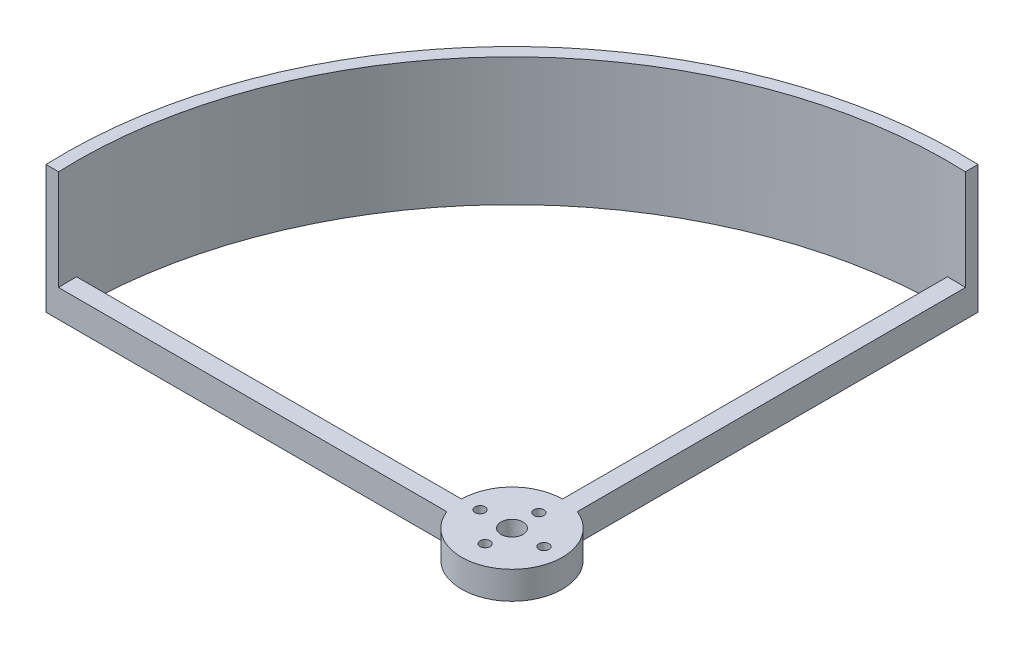
ISO-10303-21;
HEADER;
FILE_DESCRIPTION(('STEP AP214'),'2;1');
FILE_NAME('part.step','',(''),(''),'','','');
FILE_SCHEMA(('AUTOMOTIVE_DESIGN { 1 0 10303 214 1 1 1 1 }'));
ENDSEC;
DATA;
#1=APPLICATION_CONTEXT('core data for automotive mechanical design processes');
#2=APPLICATION_PROTOCOL_DEFINITION('international standard','automotive_design',2000,#1);
#3=PRODUCT_CONTEXT('',#1,'mechanical');
#4=PRODUCT('Part','Part','',(#3));
#5=PRODUCT_RELATED_PRODUCT_CATEGORY('part','',(#4));
#6=PRODUCT_DEFINITION_FORMATION('','',#4);
#7=PRODUCT_DEFINITION_CONTEXT('part definition',#1,'design');
#8=PRODUCT_DEFINITION('design','',#6,#7);
#9=PRODUCT_DEFINITION_SHAPE('','',#8);
#10=(LENGTH_UNIT() NAMED_UNIT(*) SI_UNIT(.MILLI.,.METRE.));
#11=(NAMED_UNIT(*) PLANE_ANGLE_UNIT() SI_UNIT($,.RADIAN.));
#12=(NAMED_UNIT(*) SI_UNIT($,.STERADIAN.) SOLID_ANGLE_UNIT());
#13=UNCERTAINTY_MEASURE_WITH_UNIT(LENGTH_MEASURE(1.E-05),#10,'distance_accuracy_value','');
#14=(GEOMETRIC_REPRESENTATION_CONTEXT(3) GLOBAL_UNCERTAINTY_ASSIGNED_CONTEXT((#13)) GLOBAL_UNIT_ASSIGNED_CONTEXT((#10,
#11,#12)) REPRESENTATION_CONTEXT('',''));
#15=CARTESIAN_POINT('',(0.,0.,0.));
#16=DIRECTION('',(0.,0.,1.));
#17=DIRECTION('',(1.,0.,0.));
#18=AXIS2_PLACEMENT_3D('',#15,#16,#17);
#19=CARTESIAN_POINT('',(0.,8.255,0.));
#20=DIRECTION('',(0.,-1.,0.));
#21=DIRECTION('',(0.,0.,-1.));
#22=AXIS2_PLACEMENT_3D('',#19,#20,#21);
#23=CYLINDRICAL_SURFACE('',#22,15.);
#24=DIRECTION('',(0.,-1.,0.));
#25=VECTOR('',#24,1.);
#26=CARTESIAN_POINT('',(5.45158795707583,8.255,-13.9742688090027));
#27=LINE('',#26,#25);
#28=CARTESIAN_POINT('',(5.45158795707583,8.255,-13.9742688090027));
#29=VERTEX_POINT('',#28);
#30=CARTESIAN_POINT('',(5.45158795707583,0.,-13.9742688090027));
#31=VERTEX_POINT('',#30);
#32=EDGE_CURVE('E60',#29,#31,#27,.T.);
#33=ORIENTED_EDGE('',*,*,#32,.F.);
#34=CARTESIAN_POINT('',(0.,8.255,0.));
#35=DIRECTION('',(0.,1.,0.));
#36=DIRECTION('',(0.,0.,1.));
#37=AXIS2_PLACEMENT_3D('',#34,#35,#36);
#38=CIRCLE('',#37,15.);
#39=CARTESIAN_POINT('',(-13.9742688090027,8.255,5.45158795707584));
#40=VERTEX_POINT('',#39);
#41=EDGE_CURVE('E11',#40,#29,#38,.T.);
#42=ORIENTED_EDGE('',*,*,#41,.F.);
#43=DIRECTION('',(0.,-1.,0.));
#44=VECTOR('',#43,1.);
#45=CARTESIAN_POINT('',(-13.9742688090027,8.255,5.45158795707584));
#46=LINE('',#45,#44);
#47=CARTESIAN_POINT('',(-13.9742688090027,0.,5.45158795707584));
#48=VERTEX_POINT('',#47);
#49=EDGE_CURVE('E181',#40,#48,#46,.T.);
#50=ORIENTED_EDGE('',*,*,#49,.T.);
#51=CARTESIAN_POINT('',(0.,0.,0.));
#52=DIRECTION('',(0.,1.,0.));
#53=DIRECTION('',(0.,0.,1.));
#54=AXIS2_PLACEMENT_3D('',#51,#52,#53);
#55=CIRCLE('',#54,15.);
#56=EDGE_CURVE('E187',#48,#31,#55,.T.);
#57=ORIENTED_EDGE('',*,*,#56,.T.);
#58=EDGE_LOOP('',(#33,#42,#50,#57));
#59=FACE_BOUND('',#58,.T.);
#60=ADVANCED_FACE('F37',(#59),#23,.T.);
#61=DIRECTION('',(0.,-1.,0.));
#62=VECTOR('',#61,1.);
#63=CARTESIAN_POINT('',(0.,8.255,-15.));
#64=LINE('',#63,#62);
#65=CARTESIAN_POINT('',(0.,8.255,-15.));
#66=VERTEX_POINT('',#65);
#67=CARTESIAN_POINT('',(0.,0.,-15.));
#68=VERTEX_POINT('',#67);
#69=EDGE_CURVE('E159',#66,#68,#64,.T.);
#70=ORIENTED_EDGE('',*,*,#69,.T.);
#71=CARTESIAN_POINT('',(-15.,0.,0.));
#72=VERTEX_POINT('',#71);
#73=EDGE_CURVE('E185',#68,#72,#55,.T.);
#74=ORIENTED_EDGE('',*,*,#73,.T.);
#75=DIRECTION('',(0.,-1.,0.));
#76=VECTOR('',#75,1.);
#77=CARTESIAN_POINT('',(-15.,8.255,0.));
#78=LINE('',#77,#76);
#79=CARTESIAN_POINT('',(-15.,8.255,0.));
#80=VERTEX_POINT('',#79);
#81=EDGE_CURVE('E175',#80,#72,#78,.T.);
#82=ORIENTED_EDGE('',*,*,#81,.F.);
#83=EDGE_CURVE('E45',#66,#80,#38,.T.);
#84=ORIENTED_EDGE('',*,*,#83,.F.);
#85=EDGE_LOOP('',(#70,#74,#82,#84));
#86=FACE_BOUND('',#85,.T.);
#87=ADVANCED_FACE('F243',(#86),#23,.T.);
#88=CARTESIAN_POINT('',(0.,8.255,0.));
#89=DIRECTION('',(0.,1.,0.));
#90=DIRECTION('',(0.,0.,1.));
#91=AXIS2_PLACEMENT_3D('',#88,#89,#90);
#92=PLANE('',#91);
#93=CARTESIAN_POINT('',(0.,8.255,8.));
#94=DIRECTION('',(0.,1.,0.));
#95=DIRECTION('',(0.,0.,-1.));
#96=AXIS2_PLACEMENT_3D('',#93,#94,#95);
#97=CIRCLE('',#96,1.5);
#98=CARTESIAN_POINT('',(0.,8.255,6.5));
#99=VERTEX_POINT('',#98);
#100=EDGE_CURVE('E213',#99,#99,#97,.T.);
#101=ORIENTED_EDGE('',*,*,#100,.F.);
#102=EDGE_LOOP('',(#101));
#103=FACE_BOUND('',#102,.T.);
#104=CARTESIAN_POINT('',(0.,8.255,0.));
#105=DIRECTION('',(0.,1.,0.));
#106=DIRECTION('',(0.,0.,1.));
#107=AXIS2_PLACEMENT_3D('',#104,#105,#106);
#108=CIRCLE('',#107,3.249999977);
#109=CARTESIAN_POINT('',(0.,8.255,3.249999977));
#110=VERTEX_POINT('',#109);
#111=EDGE_CURVE('E203',#110,#110,#108,.T.);
#112=ORIENTED_EDGE('',*,*,#111,.F.);
#113=EDGE_LOOP('',(#112));
#114=FACE_BOUND('',#113,.T.);
#115=CARTESIAN_POINT('',(9.5,8.255,0.));
#116=DIRECTION('',(0.,1.,0.));
#117=DIRECTION('',(0.,0.,1.));
#118=AXIS2_PLACEMENT_3D('',#115,#116,#117);
#119=CIRCLE('',#118,1.500000048);
#120=CARTESIAN_POINT('',(9.5,8.255,1.50000004800003));
#121=VERTEX_POINT('',#120);
#122=EDGE_CURVE('E200',#121,#121,#119,.T.);
#123=ORIENTED_EDGE('',*,*,#122,.F.);
#124=EDGE_LOOP('',(#123));
#125=FACE_BOUND('',#124,.T.);
#126=CARTESIAN_POINT('',(-9.5,8.255,0.));
#127=DIRECTION('',(0.,1.,0.));
#128=DIRECTION('',(0.,0.,-1.));
#129=AXIS2_PLACEMENT_3D('',#126,#127,#128);
#130=CIRCLE('',#129,1.500000048);
#131=CARTESIAN_POINT('',(-9.5,8.255,-1.50000004800003));
#132=VERTEX_POINT('',#131);
#133=EDGE_CURVE('E197',#132,#132,#130,.T.);
#134=ORIENTED_EDGE('',*,*,#133,.F.);
#135=EDGE_LOOP('',(#134));
#136=FACE_BOUND('',#135,.T.);
#137=CARTESIAN_POINT('',(0.,8.255,-8.));
#138=DIRECTION('',(0.,1.,0.));
#139=DIRECTION('',(0.,0.,1.));
#140=AXIS2_PLACEMENT_3D('',#137,#138,#139);
#141=CIRCLE('',#140,1.5);
#142=CARTESIAN_POINT('',(0.,8.255,-6.5));
#143=VERTEX_POINT('',#142);
#144=EDGE_CURVE('E193',#143,#143,#141,.T.);
#145=ORIENTED_EDGE('',*,*,#144,.F.);
#146=EDGE_LOOP('',(#145));
#147=FACE_BOUND('',#146,.T.);
#148=ORIENTED_EDGE('',*,*,#41,.T.);
#149=DIRECTION('',(0.,0.,-1.));
#150=VECTOR('',#149,1.);
#151=CARTESIAN_POINT('',(5.45158795707584,8.255,0.));
#152=LINE('',#151,#150);
#153=CARTESIAN_POINT('',(5.45158795707582,8.25500000000001,-129.488518037189));
#154=VERTEX_POINT('',#153);
#155=EDGE_CURVE('E148',#29,#154,#152,.T.);
#156=ORIENTED_EDGE('',*,*,#155,.T.);
#157=CARTESIAN_POINT('',(0.,8.255,0.));
#158=DIRECTION('',(0.,1.,0.));
#159=DIRECTION('',(0.,0.,1.));
#160=AXIS2_PLACEMENT_3D('',#157,#158,#159);
#161=CIRCLE('',#160,129.603225711095);
#162=CARTESIAN_POINT('',(0.,8.255,-129.603225711095));
#163=VERTEX_POINT('',#162);
#164=EDGE_CURVE('E151',#154,#163,#161,.T.);
#165=ORIENTED_EDGE('',*,*,#164,.T.);
#166=DIRECTION('',(0.,0.,1.));
#167=VECTOR('',#166,1.);
#168=CARTESIAN_POINT('',(0.,8.255,0.));
#169=LINE('',#168,#167);
#170=EDGE_CURVE('E154',#163,#66,#169,.T.);
#171=ORIENTED_EDGE('',*,*,#170,.T.);
#172=ORIENTED_EDGE('',*,*,#83,.T.);
#173=DIRECTION('',(1.,0.,0.));
#174=VECTOR('',#173,1.);
#175=CARTESIAN_POINT('',(0.,8.255,0.));
#176=LINE('',#175,#174);
#177=CARTESIAN_POINT('',(-129.603225711095,8.255,0.));
#178=VERTEX_POINT('',#177);
#179=EDGE_CURVE('E165',#178,#80,#176,.T.);
#180=ORIENTED_EDGE('',*,*,#179,.F.);
#181=CARTESIAN_POINT('',(0.,8.255,0.));
#182=DIRECTION('',(0.,1.,0.));
#183=DIRECTION('',(0.,0.,1.));
#184=AXIS2_PLACEMENT_3D('',#181,#182,#183);
#185=CIRCLE('',#184,129.603225711095);
#186=CARTESIAN_POINT('',(-129.488518037189,8.25500000000001,5.45158795707585));
#187=VERTEX_POINT('',#186);
#188=EDGE_CURVE('E168',#178,#187,#185,.T.);
#189=ORIENTED_EDGE('',*,*,#188,.T.);
#190=DIRECTION('',(-1.,0.,0.));
#191=VECTOR('',#190,1.);
#192=CARTESIAN_POINT('',(0.,8.255,5.45158795707583));
#193=LINE('',#192,#191);
#194=EDGE_CURVE('E172',#40,#187,#193,.T.);
#195=ORIENTED_EDGE('',*,*,#194,.F.);
#196=EDGE_LOOP('',(#148,#156,#165,#171,#172,#180,#189,#195));
#197=FACE_BOUND('',#196,.T.);
#198=ADVANCED_FACE('F233',(#103,#114,#125,#136,#147,#197),#92,.T.);
#199=CARTESIAN_POINT('',(0.,0.,0.));
#200=DIRECTION('',(0.,1.,0.));
#201=DIRECTION('',(0.,0.,1.));
#202=AXIS2_PLACEMENT_3D('',#199,#200,#201);
#203=PLANE('',#202);
#204=CARTESIAN_POINT('',(0.,0.,8.));
#205=DIRECTION('',(0.,1.,0.));
#206=DIRECTION('',(0.,0.,1.));
#207=AXIS2_PLACEMENT_3D('',#204,#205,#206);
#208=CIRCLE('',#207,1.5);
#209=CARTESIAN_POINT('',(0.,0.,9.5));
#210=VERTEX_POINT('',#209);
#211=EDGE_CURVE('E40',#210,#210,#208,.T.);
#212=ORIENTED_EDGE('',*,*,#211,.T.);
#213=EDGE_LOOP('',(#212));
#214=FACE_BOUND('',#213,.T.);
#215=CARTESIAN_POINT('',(0.,0.,0.));
#216=DIRECTION('',(0.,1.,0.));
#217=DIRECTION('',(0.,0.,1.));
#218=AXIS2_PLACEMENT_3D('',#215,#216,#217);
#219=CIRCLE('',#218,3.249999977);
#220=CARTESIAN_POINT('',(0.,0.,3.249999977));
#221=VERTEX_POINT('',#220);
#222=EDGE_CURVE('E201',#221,#221,#219,.T.);
#223=ORIENTED_EDGE('',*,*,#222,.T.);
#224=EDGE_LOOP('',(#223));
#225=FACE_BOUND('',#224,.T.);
#226=CARTESIAN_POINT('',(9.5,0.,0.));
#227=DIRECTION('',(0.,1.,0.));
#228=DIRECTION('',(0.,0.,1.));
#229=AXIS2_PLACEMENT_3D('',#226,#227,#228);
#230=CIRCLE('',#229,1.500000048);
#231=CARTESIAN_POINT('',(9.5,0.,1.50000004800003));
#232=VERTEX_POINT('',#231);
#233=EDGE_CURVE('E198',#232,#232,#230,.T.);
#234=ORIENTED_EDGE('',*,*,#233,.T.);
#235=EDGE_LOOP('',(#234));
#236=FACE_BOUND('',#235,.T.);
#237=CARTESIAN_POINT('',(-9.5,0.,0.));
#238=DIRECTION('',(0.,1.,0.));
#239=DIRECTION('',(0.,0.,1.));
#240=AXIS2_PLACEMENT_3D('',#237,#238,#239);
#241=CIRCLE('',#240,1.500000048);
#242=CARTESIAN_POINT('',(-9.5,0.,1.50000004799997));
#243=VERTEX_POINT('',#242);
#244=EDGE_CURVE('E194',#243,#243,#241,.T.);
#245=ORIENTED_EDGE('',*,*,#244,.T.);
#246=EDGE_LOOP('',(#245));
#247=FACE_BOUND('',#246,.T.);
#248=CARTESIAN_POINT('',(0.,0.,-8.));
#249=DIRECTION('',(0.,1.,0.));
#250=DIRECTION('',(0.,0.,1.));
#251=AXIS2_PLACEMENT_3D('',#248,#249,#250);
#252=CIRCLE('',#251,1.5);
#253=CARTESIAN_POINT('',(0.,0.,-6.5));
#254=VERTEX_POINT('',#253);
#255=EDGE_CURVE('E189',#254,#254,#252,.T.);
#256=ORIENTED_EDGE('',*,*,#255,.T.);
#257=EDGE_LOOP('',(#256));
#258=FACE_BOUND('',#257,.T.);
#259=DIRECTION('',(-1.,0.,0.));
#260=VECTOR('',#259,1.);
#261=CARTESIAN_POINT('',(0.,0.,5.45158795707583));
#262=LINE('',#261,#260);
#263=CARTESIAN_POINT('',(-133.238518037189,0.,5.45158795707585));
#264=VERTEX_POINT('',#263);
#265=EDGE_CURVE('E169',#48,#264,#262,.T.);
#266=ORIENTED_EDGE('',*,*,#265,.T.);
#267=CARTESIAN_POINT('',(0.,0.,0.));
#268=DIRECTION('',(0.,1.,0.));
#269=DIRECTION('',(0.,0.,1.));
#270=AXIS2_PLACEMENT_3D('',#267,#268,#269);
#271=CIRCLE('',#270,133.35);
#272=CARTESIAN_POINT('',(5.45158795707582,0.,-133.238518037189));
#273=VERTEX_POINT('',#272);
#274=EDGE_CURVE('E192',#273,#264,#271,.T.);
#275=ORIENTED_EDGE('',*,*,#274,.F.);
#276=DIRECTION('',(0.,0.,-1.));
#277=VECTOR('',#276,1.);
#278=CARTESIAN_POINT('',(5.45158795707584,0.,0.));
#279=LINE('',#278,#277);
#280=EDGE_CURVE('E139',#31,#273,#279,.T.);
#281=ORIENTED_EDGE('',*,*,#280,.F.);
#282=ORIENTED_EDGE('',*,*,#56,.F.);
#283=EDGE_LOOP('',(#266,#275,#281,#282));
#284=FACE_BOUND('',#283,.T.);
#285=CARTESIAN_POINT('',(0.,0.,0.));
#286=DIRECTION('',(0.,1.,0.));
#287=DIRECTION('',(0.,0.,1.));
#288=AXIS2_PLACEMENT_3D('',#285,#286,#287);
#289=CIRCLE('',#288,129.603225711095);
#290=CARTESIAN_POINT('',(0.,0.,-129.603225711095));
#291=VERTEX_POINT('',#290);
#292=CARTESIAN_POINT('',(-129.603225711095,0.,0.));
#293=VERTEX_POINT('',#292);
#294=EDGE_CURVE('E135',#291,#293,#289,.T.);
#295=ORIENTED_EDGE('',*,*,#294,.T.);
#296=DIRECTION('',(1.,0.,0.));
#297=VECTOR('',#296,1.);
#298=CARTESIAN_POINT('',(0.,0.,0.));
#299=LINE('',#298,#297);
#300=EDGE_CURVE('E164',#293,#72,#299,.T.);
#301=ORIENTED_EDGE('',*,*,#300,.T.);
#302=ORIENTED_EDGE('',*,*,#73,.F.);
#303=DIRECTION('',(0.,0.,1.));
#304=VECTOR('',#303,1.);
#305=CARTESIAN_POINT('',(0.,0.,0.));
#306=LINE('',#305,#304);
#307=EDGE_CURVE('E142',#291,#68,#306,.T.);
#308=ORIENTED_EDGE('',*,*,#307,.F.);
#309=EDGE_LOOP('',(#295,#301,#302,#308));
#310=FACE_BOUND('',#309,.T.);
#311=ADVANCED_FACE('F248',(#214,#225,#236,#247,#258,#284,#310),#203,.F.);
#312=CARTESIAN_POINT('',(0.,8.255,0.));
#313=DIRECTION('',(0.,0.,-1.));
#314=DIRECTION('',(-1.,0.,0.));
#315=AXIS2_PLACEMENT_3D('',#312,#313,#314);
#316=PLANE('',#315);
#317=ORIENTED_EDGE('',*,*,#300,.F.);
#318=DIRECTION('',(0.,-1.,0.));
#319=VECTOR('',#318,1.);
#320=CARTESIAN_POINT('',(-129.603225711095,8.255,0.));
#321=LINE('',#320,#319);
#322=EDGE_CURVE('E184',#178,#293,#321,.T.);
#323=ORIENTED_EDGE('',*,*,#322,.F.);
#324=ORIENTED_EDGE('',*,*,#179,.T.);
#325=ORIENTED_EDGE('',*,*,#81,.T.);
#326=EDGE_LOOP('',(#317,#323,#324,#325));
#327=FACE_BOUND('',#326,.T.);
#328=ADVANCED_FACE('F247',(#327),#316,.T.);
#329=CARTESIAN_POINT('',(0.,8.255,5.45158795707583));
#330=DIRECTION('',(0.,0.,1.));
#331=DIRECTION('',(1.,0.,0.));
#332=AXIS2_PLACEMENT_3D('',#329,#330,#331);
#333=PLANE('',#332);
#334=ORIENTED_EDGE('',*,*,#265,.F.);
#335=ORIENTED_EDGE('',*,*,#49,.F.);
#336=ORIENTED_EDGE('',*,*,#194,.T.);
#337=DIRECTION('',(0.,-1.,0.));
#338=VECTOR('',#337,1.);
#339=CARTESIAN_POINT('',(-129.488518037189,38.1,5.45158795707585));
#340=LINE('',#339,#338);
#341=CARTESIAN_POINT('',(-129.488518037189,38.1,5.45158795707585));
#342=VERTEX_POINT('',#341);
#343=EDGE_CURVE('E144',#342,#187,#340,.T.);
#344=ORIENTED_EDGE('',*,*,#343,.F.);
#345=DIRECTION('',(-1.,0.,0.));
#346=VECTOR('',#345,1.);
#347=CARTESIAN_POINT('',(0.,38.1,5.45158795707582));
#348=LINE('',#347,#346);
#349=CARTESIAN_POINT('',(-133.238518037189,38.1,5.45158795707585));
#350=VERTEX_POINT('',#349);
#351=EDGE_CURVE('E125',#342,#350,#348,.T.);
#352=ORIENTED_EDGE('',*,*,#351,.T.);
#353=DIRECTION('',(0.,-1.,0.));
#354=VECTOR('',#353,1.);
#355=CARTESIAN_POINT('',(-133.238518037189,38.1,5.45158795707585));
#356=LINE('',#355,#354);
#357=EDGE_CURVE('E121',#350,#264,#356,.T.);
#358=ORIENTED_EDGE('',*,*,#357,.T.);
#359=EDGE_LOOP('',(#334,#335,#336,#344,#352,#358));
#360=FACE_BOUND('',#359,.T.);
#361=ADVANCED_FACE('F236',(#360),#333,.T.);
#362=CARTESIAN_POINT('',(5.45158795707584,8.255,0.));
#363=DIRECTION('',(-1.,0.,0.));
#364=DIRECTION('',(0.,0.,1.));
#365=AXIS2_PLACEMENT_3D('',#362,#363,#364);
#366=PLANE('',#365);
#367=ORIENTED_EDGE('',*,*,#280,.T.);
#368=DIRECTION('',(0.,-1.,0.));
#369=VECTOR('',#368,1.);
#370=CARTESIAN_POINT('',(5.45158795707582,38.1,-133.238518037189));
#371=LINE('',#370,#369);
#372=CARTESIAN_POINT('',(5.45158795707582,38.1,-133.238518037189));
#373=VERTEX_POINT('',#372);
#374=EDGE_CURVE('E119',#373,#273,#371,.T.);
#375=ORIENTED_EDGE('',*,*,#374,.F.);
#376=DIRECTION('',(0.,0.,-1.));
#377=VECTOR('',#376,1.);
#378=CARTESIAN_POINT('',(5.45158795707582,38.1,0.));
#379=LINE('',#378,#377);
#380=CARTESIAN_POINT('',(5.45158795707582,38.1,-129.488518037189));
#381=VERTEX_POINT('',#380);
#382=EDGE_CURVE('E126',#381,#373,#379,.T.);
#383=ORIENTED_EDGE('',*,*,#382,.F.);
#384=DIRECTION('',(0.,-1.,0.));
#385=VECTOR('',#384,1.);
#386=CARTESIAN_POINT('',(5.45158795707582,38.1,-129.488518037189));
#387=LINE('',#386,#385);
#388=EDGE_CURVE('E222',#381,#154,#387,.T.);
#389=ORIENTED_EDGE('',*,*,#388,.T.);
#390=ORIENTED_EDGE('',*,*,#155,.F.);
#391=ORIENTED_EDGE('',*,*,#32,.T.);
#392=EDGE_LOOP('',(#367,#375,#383,#389,#390,#391));
#393=FACE_BOUND('',#392,.T.);
#394=ADVANCED_FACE('F137',(#393),#366,.F.);
#395=CARTESIAN_POINT('',(0.,8.255,0.));
#396=DIRECTION('',(1.,0.,0.));
#397=DIRECTION('',(0.,0.,-1.));
#398=AXIS2_PLACEMENT_3D('',#395,#396,#397);
#399=PLANE('',#398);
#400=ORIENTED_EDGE('',*,*,#307,.T.);
#401=ORIENTED_EDGE('',*,*,#69,.F.);
#402=ORIENTED_EDGE('',*,*,#170,.F.);
#403=DIRECTION('',(0.,-1.,0.));
#404=VECTOR('',#403,1.);
#405=CARTESIAN_POINT('',(0.,8.255,-129.603225711095));
#406=LINE('',#405,#404);
#407=EDGE_CURVE('E161',#163,#291,#406,.T.);
#408=ORIENTED_EDGE('',*,*,#407,.T.);
#409=EDGE_LOOP('',(#400,#401,#402,#408));
#410=FACE_BOUND('',#409,.T.);
#411=ADVANCED_FACE('F241',(#410),#399,.F.);
#412=CARTESIAN_POINT('',(0.,38.1,0.));
#413=DIRECTION('',(0.,-1.,0.));
#414=DIRECTION('',(0.,0.,-1.));
#415=AXIS2_PLACEMENT_3D('',#412,#413,#414);
#416=CYLINDRICAL_SURFACE('',#415,133.35);
#417=ORIENTED_EDGE('',*,*,#274,.T.);
#418=ORIENTED_EDGE('',*,*,#357,.F.);
#419=CARTESIAN_POINT('',(0.,38.1,0.));
#420=DIRECTION('',(0.,1.,0.));
#421=DIRECTION('',(0.,0.,1.));
#422=AXIS2_PLACEMENT_3D('',#419,#420,#421);
#423=CIRCLE('',#422,133.35);
#424=EDGE_CURVE('E114',#373,#350,#423,.T.);
#425=ORIENTED_EDGE('',*,*,#424,.F.);
#426=ORIENTED_EDGE('',*,*,#374,.T.);
#427=EDGE_LOOP('',(#417,#418,#425,#426));
#428=FACE_BOUND('',#427,.T.);
#429=ADVANCED_FACE('F117',(#428),#416,.T.);
#430=CARTESIAN_POINT('',(0.,38.1,0.));
#431=DIRECTION('',(0.,-1.,0.));
#432=DIRECTION('',(0.,0.,-1.));
#433=AXIS2_PLACEMENT_3D('',#430,#431,#432);
#434=CYLINDRICAL_SURFACE('',#433,129.603225711095);
#435=ORIENTED_EDGE('',*,*,#343,.T.);
#436=ORIENTED_EDGE('',*,*,#188,.F.);
#437=ORIENTED_EDGE('',*,*,#322,.T.);
#438=ORIENTED_EDGE('',*,*,#294,.F.);
#439=ORIENTED_EDGE('',*,*,#407,.F.);
#440=ORIENTED_EDGE('',*,*,#164,.F.);
#441=ORIENTED_EDGE('',*,*,#388,.F.);
#442=CARTESIAN_POINT('',(0.,38.1,0.));
#443=DIRECTION('',(0.,1.,0.));
#444=DIRECTION('',(0.,0.,1.));
#445=AXIS2_PLACEMENT_3D('',#442,#443,#444);
#446=CIRCLE('',#445,129.603225711095);
#447=EDGE_CURVE('E132',#381,#342,#446,.T.);
#448=ORIENTED_EDGE('',*,*,#447,.T.);
#449=EDGE_LOOP('',(#435,#436,#437,#438,#439,#440,#441,#448));
#450=FACE_BOUND('',#449,.T.);
#451=ADVANCED_FACE('F227',(#450),#434,.F.);
#452=CARTESIAN_POINT('',(0.,38.1,0.));
#453=DIRECTION('',(0.,1.,0.));
#454=DIRECTION('',(0.,0.,1.));
#455=AXIS2_PLACEMENT_3D('',#452,#453,#454);
#456=PLANE('',#455);
#457=ORIENTED_EDGE('',*,*,#382,.T.);
#458=ORIENTED_EDGE('',*,*,#424,.T.);
#459=ORIENTED_EDGE('',*,*,#351,.F.);
#460=ORIENTED_EDGE('',*,*,#447,.F.);
#461=EDGE_LOOP('',(#457,#458,#459,#460));
#462=FACE_BOUND('',#461,.T.);
#463=ADVANCED_FACE('F130',(#462),#456,.T.);
#464=CARTESIAN_POINT('',(0.,-55.245,-8.));
#465=DIRECTION('',(0.,1.,0.));
#466=DIRECTION('',(0.,0.,1.));
#467=AXIS2_PLACEMENT_3D('',#464,#465,#466);
#468=CYLINDRICAL_SURFACE('',#467,1.5);
#469=ORIENTED_EDGE('',*,*,#144,.T.);
#470=EDGE_LOOP('',(#469));
#471=FACE_BOUND('',#470,.T.);
#472=ORIENTED_EDGE('',*,*,#255,.F.);
#473=EDGE_LOOP('',(#472));
#474=FACE_BOUND('',#473,.T.);
#475=ADVANCED_FACE('F288',(#471,#474),#468,.F.);
#476=CARTESIAN_POINT('',(-9.5,-55.245,0.));
#477=DIRECTION('',(0.,1.,0.));
#478=DIRECTION('',(0.,0.,1.));
#479=AXIS2_PLACEMENT_3D('',#476,#477,#478);
#480=CYLINDRICAL_SURFACE('',#479,1.500000048);
#481=ORIENTED_EDGE('',*,*,#133,.T.);
#482=EDGE_LOOP('',(#481));
#483=FACE_BOUND('',#482,.T.);
#484=ORIENTED_EDGE('',*,*,#244,.F.);
#485=EDGE_LOOP('',(#484));
#486=FACE_BOUND('',#485,.T.);
#487=ADVANCED_FACE('F293',(#483,#486),#480,.F.);
#488=CARTESIAN_POINT('',(9.5,-55.245,0.));
#489=DIRECTION('',(0.,1.,0.));
#490=DIRECTION('',(0.,0.,1.));
#491=AXIS2_PLACEMENT_3D('',#488,#489,#490);
#492=CYLINDRICAL_SURFACE('',#491,1.500000048);
#493=ORIENTED_EDGE('',*,*,#122,.T.);
#494=EDGE_LOOP('',(#493));
#495=FACE_BOUND('',#494,.T.);
#496=ORIENTED_EDGE('',*,*,#233,.F.);
#497=EDGE_LOOP('',(#496));
#498=FACE_BOUND('',#497,.T.);
#499=ADVANCED_FACE('F303',(#495,#498),#492,.F.);
#500=CARTESIAN_POINT('',(0.,-55.245,0.));
#501=DIRECTION('',(0.,1.,0.));
#502=DIRECTION('',(0.,0.,1.));
#503=AXIS2_PLACEMENT_3D('',#500,#501,#502);
#504=CYLINDRICAL_SURFACE('',#503,3.249999977);
#505=ORIENTED_EDGE('',*,*,#111,.T.);
#506=EDGE_LOOP('',(#505));
#507=FACE_BOUND('',#506,.T.);
#508=ORIENTED_EDGE('',*,*,#222,.F.);
#509=EDGE_LOOP('',(#508));
#510=FACE_BOUND('',#509,.T.);
#511=ADVANCED_FACE('F313',(#507,#510),#504,.F.);
#512=CARTESIAN_POINT('',(0.,-55.245,8.));
#513=DIRECTION('',(0.,1.,0.));
#514=DIRECTION('',(0.,0.,1.));
#515=AXIS2_PLACEMENT_3D('',#512,#513,#514);
#516=CYLINDRICAL_SURFACE('',#515,1.5);
#517=ORIENTED_EDGE('',*,*,#100,.T.);
#518=EDGE_LOOP('',(#517));
#519=FACE_BOUND('',#518,.T.);
#520=ORIENTED_EDGE('',*,*,#211,.F.);
#521=EDGE_LOOP('',(#520));
#522=FACE_BOUND('',#521,.T.);
#523=ADVANCED_FACE('F323',(#519,#522),#516,.F.);
#524=CLOSED_SHELL('',(#60,#87,#198,#311,#328,#361,#394,#411,#429,#451,#463,#475,#487,#499,#511,#523));
#525=MANIFOLD_SOLID_BREP('B2',#524);
#526=ADVANCED_BREP_SHAPE_REPRESENTATION('',(#18,#525),#14);
#527=SHAPE_DEFINITION_REPRESENTATION(#9,#526);
ENDSEC;
END-ISO-10303-21;
